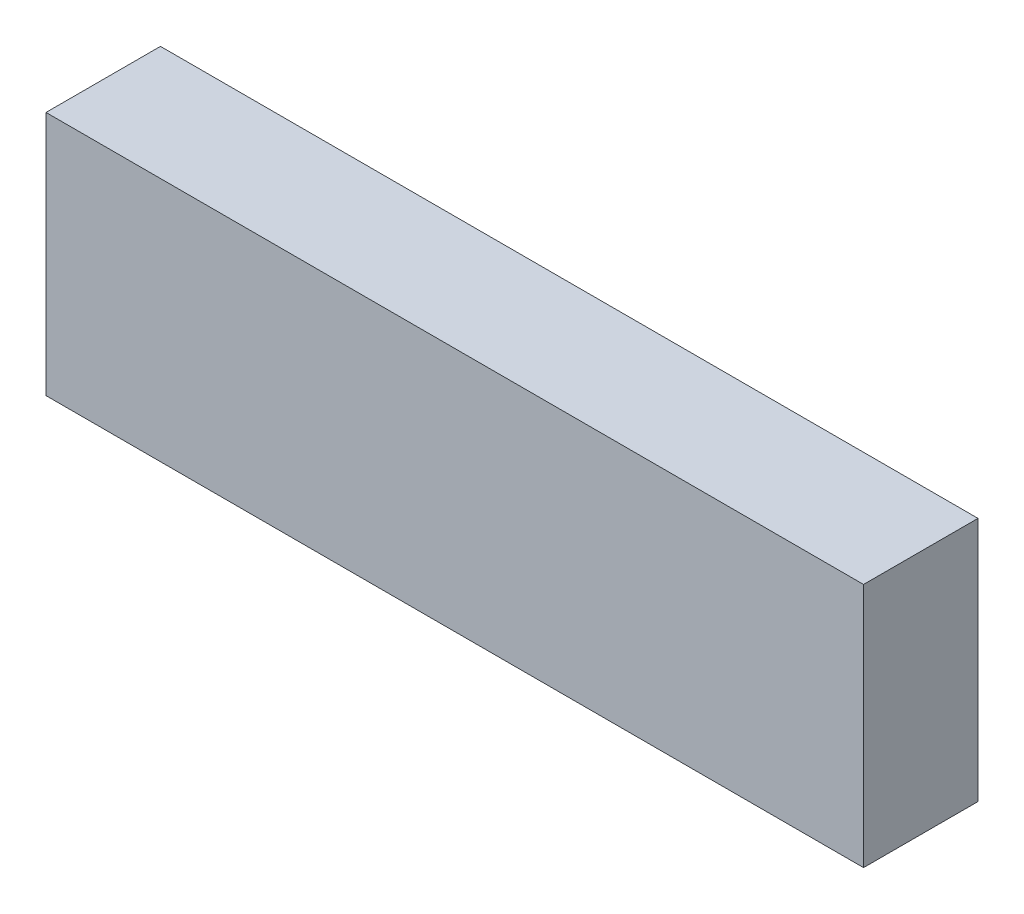
ISO-10303-21;
HEADER;
FILE_DESCRIPTION(('STEP AP214'),'2;1');
FILE_NAME('part.step','',(''),(''),'','','');
FILE_SCHEMA(('AUTOMOTIVE_DESIGN { 1 0 10303 214 1 1 1 1 }'));
ENDSEC;
DATA;
#1=APPLICATION_CONTEXT('core data for automotive mechanical design processes');
#2=APPLICATION_PROTOCOL_DEFINITION('international standard','automotive_design',2000,#1);
#3=PRODUCT_CONTEXT('',#1,'mechanical');
#4=PRODUCT('Part','Part','',(#3));
#5=PRODUCT_RELATED_PRODUCT_CATEGORY('part','',(#4));
#6=PRODUCT_DEFINITION_FORMATION('','',#4);
#7=PRODUCT_DEFINITION_CONTEXT('part definition',#1,'design');
#8=PRODUCT_DEFINITION('design','',#6,#7);
#9=PRODUCT_DEFINITION_SHAPE('','',#8);
#10=(LENGTH_UNIT() NAMED_UNIT(*) SI_UNIT(.MILLI.,.METRE.));
#11=(NAMED_UNIT(*) PLANE_ANGLE_UNIT() SI_UNIT($,.RADIAN.));
#12=(NAMED_UNIT(*) SI_UNIT($,.STERADIAN.) SOLID_ANGLE_UNIT());
#13=UNCERTAINTY_MEASURE_WITH_UNIT(LENGTH_MEASURE(1.E-05),#10,'distance_accuracy_value','');
#14=(GEOMETRIC_REPRESENTATION_CONTEXT(3) GLOBAL_UNCERTAINTY_ASSIGNED_CONTEXT((#13)) GLOBAL_UNIT_ASSIGNED_CONTEXT((#10,
#11,#12)) REPRESENTATION_CONTEXT('',''));
#15=CARTESIAN_POINT('',(0.,0.,0.));
#16=DIRECTION('',(0.,0.,1.));
#17=DIRECTION('',(1.,0.,0.));
#18=AXIS2_PLACEMENT_3D('',#15,#16,#17);
#19=CARTESIAN_POINT('',(-65.3525592008835,22.3863934762642,17.78));
#20=DIRECTION('',(1.,0.,0.));
#21=DIRECTION('',(0.,0.,-1.));
#22=AXIS2_PLACEMENT_3D('',#19,#20,#21);
#23=PLANE('',#22);
#24=DIRECTION('',(0.,-1.,0.));
#25=VECTOR('',#24,1.);
#26=CARTESIAN_POINT('',(-65.3525592008835,22.3863934762642,0.));
#27=LINE('',#26,#25);
#28=CARTESIAN_POINT('',(-65.3525592008835,22.3863934762642,0.));
#29=VERTEX_POINT('',#28);
#30=CARTESIAN_POINT('',(-65.3525592008835,-15.7136065237358,0.));
#31=VERTEX_POINT('',#30);
#32=EDGE_CURVE('E94',#29,#31,#27,.T.);
#33=ORIENTED_EDGE('',*,*,#32,.T.);
#34=DIRECTION('',(0.,0.,-1.));
#35=VECTOR('',#34,1.);
#36=CARTESIAN_POINT('',(-65.3525592008835,-15.7136065237358,17.78));
#37=LINE('',#36,#35);
#38=CARTESIAN_POINT('',(-65.3525592008835,-15.7136065237358,17.78));
#39=VERTEX_POINT('',#38);
#40=EDGE_CURVE('E11',#39,#31,#37,.T.);
#41=ORIENTED_EDGE('',*,*,#40,.F.);
#42=DIRECTION('',(0.,-1.,0.));
#43=VECTOR('',#42,1.);
#44=CARTESIAN_POINT('',(-65.3525592008835,22.3863934762642,17.78));
#45=LINE('',#44,#43);
#46=CARTESIAN_POINT('',(-65.3525592008835,22.3863934762642,17.78));
#47=VERTEX_POINT('',#46);
#48=EDGE_CURVE('E82',#47,#39,#45,.T.);
#49=ORIENTED_EDGE('',*,*,#48,.F.);
#50=DIRECTION('',(0.,0.,-1.));
#51=VECTOR('',#50,1.);
#52=CARTESIAN_POINT('',(-65.3525592008835,22.3863934762642,17.78));
#53=LINE('',#52,#51);
#54=EDGE_CURVE('E90',#47,#29,#53,.T.);
#55=ORIENTED_EDGE('',*,*,#54,.T.);
#56=EDGE_LOOP('',(#33,#41,#49,#55));
#57=FACE_BOUND('',#56,.T.);
#58=ADVANCED_FACE('F31',(#57),#23,.F.);
#59=CARTESIAN_POINT('',(-65.3525592008835,-15.7136065237358,17.78));
#60=DIRECTION('',(0.,1.,0.));
#61=DIRECTION('',(0.,0.,1.));
#62=AXIS2_PLACEMENT_3D('',#59,#60,#61);
#63=PLANE('',#62);
#64=DIRECTION('',(1.,0.,0.));
#65=VECTOR('',#64,1.);
#66=CARTESIAN_POINT('',(-65.3525592008835,-15.7136065237358,0.));
#67=LINE('',#66,#65);
#68=CARTESIAN_POINT('',(61.6474407991164,-15.7136065237358,0.));
#69=VERTEX_POINT('',#68);
#70=EDGE_CURVE('E86',#31,#69,#67,.T.);
#71=ORIENTED_EDGE('',*,*,#70,.T.);
#72=DIRECTION('',(0.,0.,-1.));
#73=VECTOR('',#72,1.);
#74=CARTESIAN_POINT('',(61.6474407991164,-15.7136065237358,17.78));
#75=LINE('',#74,#73);
#76=CARTESIAN_POINT('',(61.6474407991164,-15.7136065237358,17.78));
#77=VERTEX_POINT('',#76);
#78=EDGE_CURVE('E39',#77,#69,#75,.T.);
#79=ORIENTED_EDGE('',*,*,#78,.F.);
#80=DIRECTION('',(1.,0.,0.));
#81=VECTOR('',#80,1.);
#82=CARTESIAN_POINT('',(-65.3525592008835,-15.7136065237358,17.78));
#83=LINE('',#82,#81);
#84=EDGE_CURVE('E77',#39,#77,#83,.T.);
#85=ORIENTED_EDGE('',*,*,#84,.F.);
#86=ORIENTED_EDGE('',*,*,#40,.T.);
#87=EDGE_LOOP('',(#71,#79,#85,#86));
#88=FACE_BOUND('',#87,.T.);
#89=ADVANCED_FACE('F85',(#88),#63,.F.);
#90=CARTESIAN_POINT('',(61.6474407991164,22.3863934762642,17.78));
#91=DIRECTION('',(-1.,0.,0.));
#92=DIRECTION('',(0.,0.,1.));
#93=AXIS2_PLACEMENT_3D('',#90,#91,#92);
#94=PLANE('',#93);
#95=DIRECTION('',(0.,1.,0.));
#96=VECTOR('',#95,1.);
#97=CARTESIAN_POINT('',(61.6474407991164,22.3863934762642,0.));
#98=LINE('',#97,#96);
#99=CARTESIAN_POINT('',(61.6474407991164,22.3863934762642,0.));
#100=VERTEX_POINT('',#99);
#101=EDGE_CURVE('E64',#69,#100,#98,.T.);
#102=ORIENTED_EDGE('',*,*,#101,.T.);
#103=DIRECTION('',(0.,0.,-1.));
#104=VECTOR('',#103,1.);
#105=CARTESIAN_POINT('',(61.6474407991164,22.3863934762642,17.78));
#106=LINE('',#105,#104);
#107=CARTESIAN_POINT('',(61.6474407991164,22.3863934762642,17.78));
#108=VERTEX_POINT('',#107);
#109=EDGE_CURVE('E87',#108,#100,#106,.T.);
#110=ORIENTED_EDGE('',*,*,#109,.F.);
#111=DIRECTION('',(0.,1.,0.));
#112=VECTOR('',#111,1.);
#113=CARTESIAN_POINT('',(61.6474407991164,22.3863934762642,17.78));
#114=LINE('',#113,#112);
#115=EDGE_CURVE('E80',#77,#108,#114,.T.);
#116=ORIENTED_EDGE('',*,*,#115,.F.);
#117=ORIENTED_EDGE('',*,*,#78,.T.);
#118=EDGE_LOOP('',(#102,#110,#116,#117));
#119=FACE_BOUND('',#118,.T.);
#120=ADVANCED_FACE('F88',(#119),#94,.F.);
#121=CARTESIAN_POINT('',(-65.3525592008835,22.3863934762642,17.78));
#122=DIRECTION('',(0.,-1.,0.));
#123=DIRECTION('',(0.,0.,-1.));
#124=AXIS2_PLACEMENT_3D('',#121,#122,#123);
#125=PLANE('',#124);
#126=DIRECTION('',(-1.,0.,0.));
#127=VECTOR('',#126,1.);
#128=CARTESIAN_POINT('',(-65.3525592008835,22.3863934762642,0.));
#129=LINE('',#128,#127);
#130=EDGE_CURVE('E70',#100,#29,#129,.T.);
#131=ORIENTED_EDGE('',*,*,#130,.T.);
#132=ORIENTED_EDGE('',*,*,#54,.F.);
#133=DIRECTION('',(-1.,0.,0.));
#134=VECTOR('',#133,1.);
#135=CARTESIAN_POINT('',(-65.3525592008835,22.3863934762642,17.78));
#136=LINE('',#135,#134);
#137=EDGE_CURVE('E47',#108,#47,#136,.T.);
#138=ORIENTED_EDGE('',*,*,#137,.F.);
#139=ORIENTED_EDGE('',*,*,#109,.T.);
#140=EDGE_LOOP('',(#131,#132,#138,#139));
#141=FACE_BOUND('',#140,.T.);
#142=ADVANCED_FACE('F101',(#141),#125,.F.);
#143=CARTESIAN_POINT('',(-65.3525592008835,-15.7136065237358,17.78));
#144=DIRECTION('',(0.,0.,1.));
#145=DIRECTION('',(1.,0.,0.));
#146=AXIS2_PLACEMENT_3D('',#143,#144,#145);
#147=PLANE('',#146);
#148=ORIENTED_EDGE('',*,*,#48,.T.);
#149=ORIENTED_EDGE('',*,*,#84,.T.);
#150=ORIENTED_EDGE('',*,*,#115,.T.);
#151=ORIENTED_EDGE('',*,*,#137,.T.);
#152=EDGE_LOOP('',(#148,#149,#150,#151));
#153=FACE_BOUND('',#152,.T.);
#154=ADVANCED_FACE('F78',(#153),#147,.T.);
#155=CARTESIAN_POINT('',(-65.3525592008835,-15.7136065237358,0.));
#156=DIRECTION('',(0.,0.,1.));
#157=DIRECTION('',(1.,0.,0.));
#158=AXIS2_PLACEMENT_3D('',#155,#156,#157);
#159=PLANE('',#158);
#160=ORIENTED_EDGE('',*,*,#32,.F.);
#161=ORIENTED_EDGE('',*,*,#130,.F.);
#162=ORIENTED_EDGE('',*,*,#101,.F.);
#163=ORIENTED_EDGE('',*,*,#70,.F.);
#164=EDGE_LOOP('',(#160,#161,#162,#163));
#165=FACE_BOUND('',#164,.T.);
#166=ADVANCED_FACE('F104',(#165),#159,.F.);
#167=CLOSED_SHELL('',(#58,#89,#120,#142,#154,#166));
#168=MANIFOLD_SOLID_BREP('B2',#167);
#169=ADVANCED_BREP_SHAPE_REPRESENTATION('',(#18,#168),#14);
#170=SHAPE_DEFINITION_REPRESENTATION(#9,#169);
ENDSEC;
END-ISO-10303-21;
